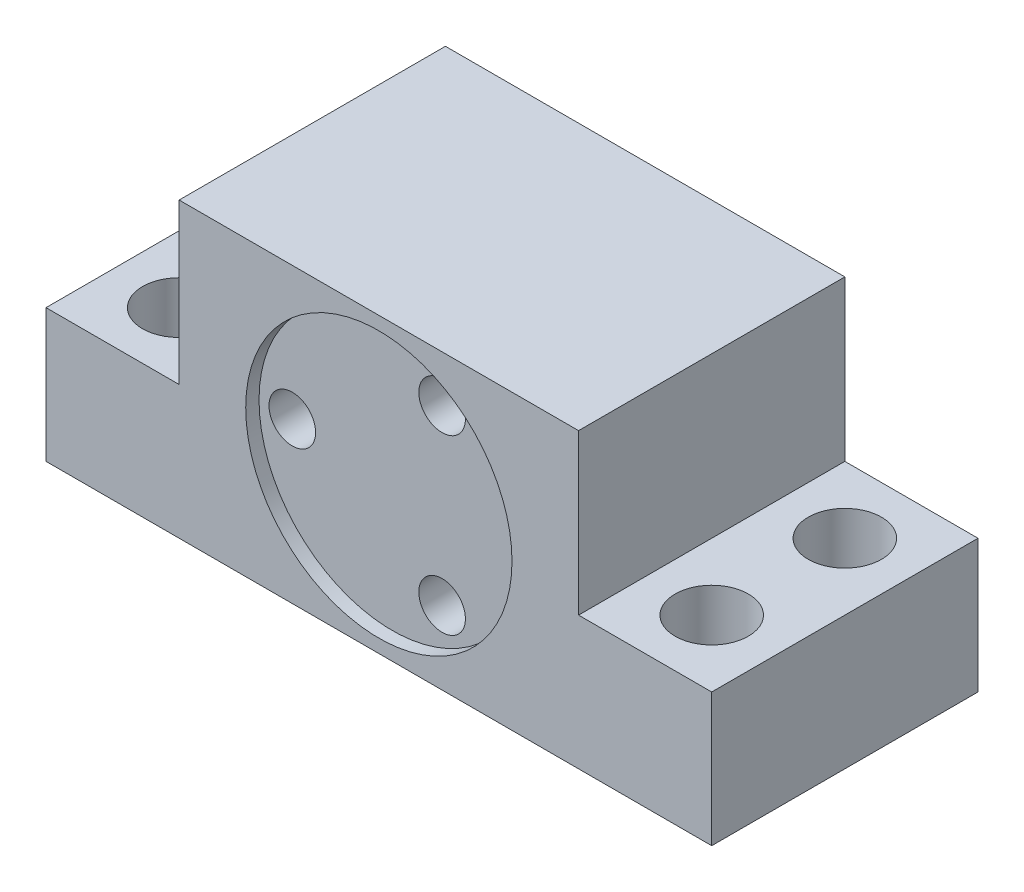
ISO-10303-21;
HEADER;
FILE_DESCRIPTION(('STEP AP214'),'2;1');
FILE_NAME('part.step','',(''),(''),'','','');
FILE_SCHEMA(('AUTOMOTIVE_DESIGN { 1 0 10303 214 1 1 1 1 }'));
ENDSEC;
DATA;
#1=APPLICATION_CONTEXT('core data for automotive mechanical design processes');
#2=APPLICATION_PROTOCOL_DEFINITION('international standard','automotive_design',2000,#1);
#3=PRODUCT_CONTEXT('',#1,'mechanical');
#4=PRODUCT('Part','Part','',(#3));
#5=PRODUCT_RELATED_PRODUCT_CATEGORY('part','',(#4));
#6=PRODUCT_DEFINITION_FORMATION('','',#4);
#7=PRODUCT_DEFINITION_CONTEXT('part definition',#1,'design');
#8=PRODUCT_DEFINITION('design','',#6,#7);
#9=PRODUCT_DEFINITION_SHAPE('','',#8);
#10=(LENGTH_UNIT() NAMED_UNIT(*) SI_UNIT(.MILLI.,.METRE.));
#11=(NAMED_UNIT(*) PLANE_ANGLE_UNIT() SI_UNIT($,.RADIAN.));
#12=(NAMED_UNIT(*) SI_UNIT($,.STERADIAN.) SOLID_ANGLE_UNIT());
#13=UNCERTAINTY_MEASURE_WITH_UNIT(LENGTH_MEASURE(1.E-05),#10,'distance_accuracy_value','');
#14=(GEOMETRIC_REPRESENTATION_CONTEXT(3) GLOBAL_UNCERTAINTY_ASSIGNED_CONTEXT((#13)) GLOBAL_UNIT_ASSIGNED_CONTEXT((#10,
#11,#12)) REPRESENTATION_CONTEXT('',''));
#15=CARTESIAN_POINT('',(0.,0.,0.));
#16=DIRECTION('',(0.,0.,1.));
#17=DIRECTION('',(1.,0.,0.));
#18=AXIS2_PLACEMENT_3D('',#15,#16,#17);
#19=CARTESIAN_POINT('',(15.,22.,20.));
#20=DIRECTION('',(-1.,0.,0.));
#21=DIRECTION('',(0.,-1.,0.));
#22=AXIS2_PLACEMENT_3D('',#19,#20,#21);
#23=PLANE('',#22);
#24=DIRECTION('',(0.,1.,0.));
#25=VECTOR('',#24,1.);
#26=CARTESIAN_POINT('',(15.,22.,0.));
#27=LINE('',#26,#25);
#28=CARTESIAN_POINT('',(15.,10.,0.));
#29=VERTEX_POINT('',#28);
#30=CARTESIAN_POINT('',(15.,22.,0.));
#31=VERTEX_POINT('',#30);
#32=EDGE_CURVE('E113',#29,#31,#27,.T.);
#33=ORIENTED_EDGE('',*,*,#32,.T.);
#34=DIRECTION('',(0.,0.,-1.));
#35=VECTOR('',#34,1.);
#36=CARTESIAN_POINT('',(15.,22.,20.));
#37=LINE('',#36,#35);
#38=CARTESIAN_POINT('',(15.,22.,20.));
#39=VERTEX_POINT('',#38);
#40=EDGE_CURVE('E11',#39,#31,#37,.T.);
#41=ORIENTED_EDGE('',*,*,#40,.F.);
#42=DIRECTION('',(0.,1.,0.));
#43=VECTOR('',#42,1.);
#44=CARTESIAN_POINT('',(15.,22.,20.));
#45=LINE('',#44,#43);
#46=CARTESIAN_POINT('',(15.,10.,20.));
#47=VERTEX_POINT('',#46);
#48=EDGE_CURVE('E128',#47,#39,#45,.T.);
#49=ORIENTED_EDGE('',*,*,#48,.F.);
#50=DIRECTION('',(0.,0.,-1.));
#51=VECTOR('',#50,1.);
#52=CARTESIAN_POINT('',(15.,10.,20.));
#53=LINE('',#52,#51);
#54=EDGE_CURVE('E109',#47,#29,#53,.T.);
#55=ORIENTED_EDGE('',*,*,#54,.T.);
#56=EDGE_LOOP('',(#33,#41,#49,#55));
#57=FACE_BOUND('',#56,.T.);
#58=ADVANCED_FACE('F17',(#57),#23,.F.);
#59=CARTESIAN_POINT('',(-15.,22.,20.));
#60=DIRECTION('',(0.,-1.,0.));
#61=DIRECTION('',(0.,0.,-1.));
#62=AXIS2_PLACEMENT_3D('',#59,#60,#61);
#63=PLANE('',#62);
#64=DIRECTION('',(-1.,0.,0.));
#65=VECTOR('',#64,1.);
#66=CARTESIAN_POINT('',(-15.,22.,0.));
#67=LINE('',#66,#65);
#68=CARTESIAN_POINT('',(-15.,22.,0.));
#69=VERTEX_POINT('',#68);
#70=EDGE_CURVE('E116',#31,#69,#67,.T.);
#71=ORIENTED_EDGE('',*,*,#70,.T.);
#72=DIRECTION('',(0.,0.,-1.));
#73=VECTOR('',#72,1.);
#74=CARTESIAN_POINT('',(-15.,22.,20.));
#75=LINE('',#74,#73);
#76=CARTESIAN_POINT('',(-15.,22.,20.));
#77=VERTEX_POINT('',#76);
#78=EDGE_CURVE('E25',#77,#69,#75,.T.);
#79=ORIENTED_EDGE('',*,*,#78,.F.);
#80=DIRECTION('',(-1.,0.,0.));
#81=VECTOR('',#80,1.);
#82=CARTESIAN_POINT('',(-15.,22.,20.));
#83=LINE('',#82,#81);
#84=EDGE_CURVE('E76',#39,#77,#83,.T.);
#85=ORIENTED_EDGE('',*,*,#84,.F.);
#86=ORIENTED_EDGE('',*,*,#40,.T.);
#87=EDGE_LOOP('',(#71,#79,#85,#86));
#88=FACE_BOUND('',#87,.T.);
#89=ADVANCED_FACE('F237',(#88),#63,.F.);
#90=CARTESIAN_POINT('',(-15.,22.,20.));
#91=DIRECTION('',(1.,0.,0.));
#92=DIRECTION('',(0.,1.,0.));
#93=AXIS2_PLACEMENT_3D('',#90,#91,#92);
#94=PLANE('',#93);
#95=DIRECTION('',(0.,-1.,0.));
#96=VECTOR('',#95,1.);
#97=CARTESIAN_POINT('',(-15.,22.,0.));
#98=LINE('',#97,#96);
#99=CARTESIAN_POINT('',(-15.,10.,0.));
#100=VERTEX_POINT('',#99);
#101=EDGE_CURVE('E119',#69,#100,#98,.T.);
#102=ORIENTED_EDGE('',*,*,#101,.T.);
#103=DIRECTION('',(0.,0.,-1.));
#104=VECTOR('',#103,1.);
#105=CARTESIAN_POINT('',(-15.,10.,20.));
#106=LINE('',#105,#104);
#107=CARTESIAN_POINT('',(-15.,10.,20.));
#108=VERTEX_POINT('',#107);
#109=EDGE_CURVE('E135',#108,#100,#106,.T.);
#110=ORIENTED_EDGE('',*,*,#109,.F.);
#111=DIRECTION('',(0.,-1.,0.));
#112=VECTOR('',#111,1.);
#113=CARTESIAN_POINT('',(-15.,22.,20.));
#114=LINE('',#113,#112);
#115=EDGE_CURVE('E143',#77,#108,#114,.T.);
#116=ORIENTED_EDGE('',*,*,#115,.F.);
#117=ORIENTED_EDGE('',*,*,#78,.T.);
#118=EDGE_LOOP('',(#102,#110,#116,#117));
#119=FACE_BOUND('',#118,.T.);
#120=ADVANCED_FACE('F141',(#119),#94,.F.);
#121=CARTESIAN_POINT('',(-15.,10.,20.));
#122=DIRECTION('',(0.,-1.,0.));
#123=DIRECTION('',(0.,0.,-1.));
#124=AXIS2_PLACEMENT_3D('',#121,#122,#123);
#125=PLANE('',#124);
#126=CARTESIAN_POINT('',(-20.,10.,15.));
#127=DIRECTION('',(0.,1.,0.));
#128=DIRECTION('',(0.,0.,1.));
#129=AXIS2_PLACEMENT_3D('',#126,#127,#128);
#130=CIRCLE('',#129,2.75);
#131=CARTESIAN_POINT('',(-20.,10.,17.75));
#132=VERTEX_POINT('',#131);
#133=EDGE_CURVE('E187',#132,#132,#130,.T.);
#134=ORIENTED_EDGE('',*,*,#133,.F.);
#135=EDGE_LOOP('',(#134));
#136=FACE_BOUND('',#135,.T.);
#137=CARTESIAN_POINT('',(-20.,10.,5.));
#138=DIRECTION('',(0.,1.,0.));
#139=DIRECTION('',(0.,0.,1.));
#140=AXIS2_PLACEMENT_3D('',#137,#138,#139);
#141=CIRCLE('',#140,2.75);
#142=CARTESIAN_POINT('',(-20.,10.,7.75));
#143=VERTEX_POINT('',#142);
#144=EDGE_CURVE('E181',#143,#143,#141,.T.);
#145=ORIENTED_EDGE('',*,*,#144,.F.);
#146=EDGE_LOOP('',(#145));
#147=FACE_BOUND('',#146,.T.);
#148=DIRECTION('',(-1.,0.,0.));
#149=VECTOR('',#148,1.);
#150=CARTESIAN_POINT('',(-15.,10.,0.));
#151=LINE('',#150,#149);
#152=CARTESIAN_POINT('',(-25.,10.,0.));
#153=VERTEX_POINT('',#152);
#154=EDGE_CURVE('E121',#100,#153,#151,.T.);
#155=ORIENTED_EDGE('',*,*,#154,.T.);
#156=DIRECTION('',(0.,0.,-1.));
#157=VECTOR('',#156,1.);
#158=CARTESIAN_POINT('',(-25.,10.,20.));
#159=LINE('',#158,#157);
#160=CARTESIAN_POINT('',(-25.,10.,20.));
#161=VERTEX_POINT('',#160);
#162=EDGE_CURVE('E132',#161,#153,#159,.T.);
#163=ORIENTED_EDGE('',*,*,#162,.F.);
#164=DIRECTION('',(-1.,0.,0.));
#165=VECTOR('',#164,1.);
#166=CARTESIAN_POINT('',(-15.,10.,20.));
#167=LINE('',#166,#165);
#168=EDGE_CURVE('E155',#108,#161,#167,.T.);
#169=ORIENTED_EDGE('',*,*,#168,.F.);
#170=ORIENTED_EDGE('',*,*,#109,.T.);
#171=EDGE_LOOP('',(#155,#163,#169,#170));
#172=FACE_BOUND('',#171,.T.);
#173=ADVANCED_FACE('F151',(#136,#147,#172),#125,.F.);
#174=CARTESIAN_POINT('',(-25.,10.,20.));
#175=DIRECTION('',(1.,0.,0.));
#176=DIRECTION('',(0.,0.,-1.));
#177=AXIS2_PLACEMENT_3D('',#174,#175,#176);
#178=PLANE('',#177);
#179=DIRECTION('',(0.,-1.,0.));
#180=VECTOR('',#179,1.);
#181=CARTESIAN_POINT('',(-25.,10.,0.));
#182=LINE('',#181,#180);
#183=CARTESIAN_POINT('',(-25.,0.,0.));
#184=VERTEX_POINT('',#183);
#185=EDGE_CURVE('E123',#153,#184,#182,.T.);
#186=ORIENTED_EDGE('',*,*,#185,.T.);
#187=DIRECTION('',(0.,0.,-1.));
#188=VECTOR('',#187,1.);
#189=CARTESIAN_POINT('',(-25.,0.,20.));
#190=LINE('',#189,#188);
#191=CARTESIAN_POINT('',(-25.,0.,20.));
#192=VERTEX_POINT('',#191);
#193=EDGE_CURVE('E104',#192,#184,#190,.T.);
#194=ORIENTED_EDGE('',*,*,#193,.F.);
#195=DIRECTION('',(0.,-1.,0.));
#196=VECTOR('',#195,1.);
#197=CARTESIAN_POINT('',(-25.,10.,20.));
#198=LINE('',#197,#196);
#199=EDGE_CURVE('E95',#161,#192,#198,.T.);
#200=ORIENTED_EDGE('',*,*,#199,.F.);
#201=ORIENTED_EDGE('',*,*,#162,.T.);
#202=EDGE_LOOP('',(#186,#194,#200,#201));
#203=FACE_BOUND('',#202,.T.);
#204=ADVANCED_FACE('F154',(#203),#178,.F.);
#205=CARTESIAN_POINT('',(25.,0.,20.));
#206=DIRECTION('',(0.,1.,0.));
#207=DIRECTION('',(0.,0.,1.));
#208=AXIS2_PLACEMENT_3D('',#205,#206,#207);
#209=PLANE('',#208);
#210=CARTESIAN_POINT('',(-20.,0.,15.));
#211=DIRECTION('',(0.,1.,0.));
#212=DIRECTION('',(0.,0.,1.));
#213=AXIS2_PLACEMENT_3D('',#210,#211,#212);
#214=CIRCLE('',#213,2.75);
#215=CARTESIAN_POINT('',(-20.,0.,17.75));
#216=VERTEX_POINT('',#215);
#217=EDGE_CURVE('E184',#216,#216,#214,.T.);
#218=ORIENTED_EDGE('',*,*,#217,.T.);
#219=EDGE_LOOP('',(#218));
#220=FACE_BOUND('',#219,.T.);
#221=CARTESIAN_POINT('',(-20.,0.,5.));
#222=DIRECTION('',(0.,1.,0.));
#223=DIRECTION('',(0.,0.,1.));
#224=AXIS2_PLACEMENT_3D('',#221,#222,#223);
#225=CIRCLE('',#224,2.75);
#226=CARTESIAN_POINT('',(-20.,0.,7.75));
#227=VERTEX_POINT('',#226);
#228=EDGE_CURVE('E178',#227,#227,#225,.T.);
#229=ORIENTED_EDGE('',*,*,#228,.T.);
#230=EDGE_LOOP('',(#229));
#231=FACE_BOUND('',#230,.T.);
#232=CARTESIAN_POINT('',(20.,0.,15.));
#233=DIRECTION('',(0.,1.,0.));
#234=DIRECTION('',(0.,0.,1.));
#235=AXIS2_PLACEMENT_3D('',#232,#233,#234);
#236=CIRCLE('',#235,2.75);
#237=CARTESIAN_POINT('',(20.,0.,17.75));
#238=VERTEX_POINT('',#237);
#239=EDGE_CURVE('E172',#238,#238,#236,.T.);
#240=ORIENTED_EDGE('',*,*,#239,.T.);
#241=EDGE_LOOP('',(#240));
#242=FACE_BOUND('',#241,.T.);
#243=CARTESIAN_POINT('',(20.,0.,5.));
#244=DIRECTION('',(0.,1.,0.));
#245=DIRECTION('',(0.,0.,1.));
#246=AXIS2_PLACEMENT_3D('',#243,#244,#245);
#247=CIRCLE('',#246,2.75);
#248=CARTESIAN_POINT('',(20.,0.,7.75));
#249=VERTEX_POINT('',#248);
#250=EDGE_CURVE('E164',#249,#249,#247,.T.);
#251=ORIENTED_EDGE('',*,*,#250,.T.);
#252=EDGE_LOOP('',(#251));
#253=FACE_BOUND('',#252,.T.);
#254=DIRECTION('',(1.,0.,0.));
#255=VECTOR('',#254,1.);
#256=CARTESIAN_POINT('',(25.,0.,0.));
#257=LINE('',#256,#255);
#258=CARTESIAN_POINT('',(25.,0.,0.));
#259=VERTEX_POINT('',#258);
#260=EDGE_CURVE('E103',#184,#259,#257,.T.);
#261=ORIENTED_EDGE('',*,*,#260,.T.);
#262=DIRECTION('',(0.,0.,-1.));
#263=VECTOR('',#262,1.);
#264=CARTESIAN_POINT('',(25.,0.,20.));
#265=LINE('',#264,#263);
#266=CARTESIAN_POINT('',(25.,0.,20.));
#267=VERTEX_POINT('',#266);
#268=EDGE_CURVE('E100',#267,#259,#265,.T.);
#269=ORIENTED_EDGE('',*,*,#268,.F.);
#270=DIRECTION('',(1.,0.,0.));
#271=VECTOR('',#270,1.);
#272=CARTESIAN_POINT('',(25.,0.,20.));
#273=LINE('',#272,#271);
#274=EDGE_CURVE('E89',#192,#267,#273,.T.);
#275=ORIENTED_EDGE('',*,*,#274,.F.);
#276=ORIENTED_EDGE('',*,*,#193,.T.);
#277=EDGE_LOOP('',(#261,#269,#275,#276));
#278=FACE_BOUND('',#277,.T.);
#279=ADVANCED_FACE('F101',(#220,#231,#242,#253,#278),#209,.F.);
#280=CARTESIAN_POINT('',(25.,10.,20.));
#281=DIRECTION('',(-1.,0.,0.));
#282=DIRECTION('',(0.,0.,1.));
#283=AXIS2_PLACEMENT_3D('',#280,#281,#282);
#284=PLANE('',#283);
#285=DIRECTION('',(0.,1.,0.));
#286=VECTOR('',#285,1.);
#287=CARTESIAN_POINT('',(25.,10.,0.));
#288=LINE('',#287,#286);
#289=CARTESIAN_POINT('',(25.,10.,0.));
#290=VERTEX_POINT('',#289);
#291=EDGE_CURVE('E62',#259,#290,#288,.T.);
#292=ORIENTED_EDGE('',*,*,#291,.T.);
#293=DIRECTION('',(0.,0.,-1.));
#294=VECTOR('',#293,1.);
#295=CARTESIAN_POINT('',(25.,10.,20.));
#296=LINE('',#295,#294);
#297=CARTESIAN_POINT('',(25.,10.,20.));
#298=VERTEX_POINT('',#297);
#299=EDGE_CURVE('E105',#298,#290,#296,.T.);
#300=ORIENTED_EDGE('',*,*,#299,.F.);
#301=DIRECTION('',(0.,1.,0.));
#302=VECTOR('',#301,1.);
#303=CARTESIAN_POINT('',(25.,10.,20.));
#304=LINE('',#303,#302);
#305=EDGE_CURVE('E93',#267,#298,#304,.T.);
#306=ORIENTED_EDGE('',*,*,#305,.F.);
#307=ORIENTED_EDGE('',*,*,#268,.T.);
#308=EDGE_LOOP('',(#292,#300,#306,#307));
#309=FACE_BOUND('',#308,.T.);
#310=ADVANCED_FACE('F107',(#309),#284,.F.);
#311=CARTESIAN_POINT('',(15.,10.,20.));
#312=DIRECTION('',(0.,-1.,0.));
#313=DIRECTION('',(0.,0.,-1.));
#314=AXIS2_PLACEMENT_3D('',#311,#312,#313);
#315=PLANE('',#314);
#316=CARTESIAN_POINT('',(20.,10.,15.));
#317=DIRECTION('',(0.,1.,0.));
#318=DIRECTION('',(0.,0.,1.));
#319=AXIS2_PLACEMENT_3D('',#316,#317,#318);
#320=CIRCLE('',#319,2.75);
#321=CARTESIAN_POINT('',(20.,10.,17.75));
#322=VERTEX_POINT('',#321);
#323=EDGE_CURVE('E175',#322,#322,#320,.T.);
#324=ORIENTED_EDGE('',*,*,#323,.F.);
#325=EDGE_LOOP('',(#324));
#326=FACE_BOUND('',#325,.T.);
#327=CARTESIAN_POINT('',(20.,10.,5.));
#328=DIRECTION('',(0.,1.,0.));
#329=DIRECTION('',(0.,0.,1.));
#330=AXIS2_PLACEMENT_3D('',#327,#328,#329);
#331=CIRCLE('',#330,2.75);
#332=CARTESIAN_POINT('',(20.,10.,7.75));
#333=VERTEX_POINT('',#332);
#334=EDGE_CURVE('E169',#333,#333,#331,.T.);
#335=ORIENTED_EDGE('',*,*,#334,.F.);
#336=EDGE_LOOP('',(#335));
#337=FACE_BOUND('',#336,.T.);
#338=DIRECTION('',(-1.,0.,0.));
#339=VECTOR('',#338,1.);
#340=CARTESIAN_POINT('',(15.,10.,0.));
#341=LINE('',#340,#339);
#342=EDGE_CURVE('E68',#290,#29,#341,.T.);
#343=ORIENTED_EDGE('',*,*,#342,.T.);
#344=ORIENTED_EDGE('',*,*,#54,.F.);
#345=DIRECTION('',(-1.,0.,0.));
#346=VECTOR('',#345,1.);
#347=CARTESIAN_POINT('',(15.,10.,20.));
#348=LINE('',#347,#346);
#349=EDGE_CURVE('E33',#298,#47,#348,.T.);
#350=ORIENTED_EDGE('',*,*,#349,.F.);
#351=ORIENTED_EDGE('',*,*,#299,.T.);
#352=EDGE_LOOP('',(#343,#344,#350,#351));
#353=FACE_BOUND('',#352,.T.);
#354=ADVANCED_FACE('F245',(#326,#337,#353),#315,.F.);
#355=CARTESIAN_POINT('',(0.,0.,20.));
#356=DIRECTION('',(0.,0.,1.));
#357=DIRECTION('',(1.,0.,0.));
#358=AXIS2_PLACEMENT_3D('',#355,#356,#357);
#359=PLANE('',#358);
#360=CARTESIAN_POINT('',(0.,11.,20.));
#361=DIRECTION('',(0.,0.,1.));
#362=DIRECTION('',(1.,0.,0.));
#363=AXIS2_PLACEMENT_3D('',#360,#361,#362);
#364=CIRCLE('',#363,10.);
#365=CARTESIAN_POINT('',(10.,11.,20.));
#366=VERTEX_POINT('',#365);
#367=EDGE_CURVE('E161',#366,#366,#364,.T.);
#368=ORIENTED_EDGE('',*,*,#367,.F.);
#369=EDGE_LOOP('',(#368));
#370=FACE_BOUND('',#369,.T.);
#371=ORIENTED_EDGE('',*,*,#48,.T.);
#372=ORIENTED_EDGE('',*,*,#84,.T.);
#373=ORIENTED_EDGE('',*,*,#115,.T.);
#374=ORIENTED_EDGE('',*,*,#168,.T.);
#375=ORIENTED_EDGE('',*,*,#199,.T.);
#376=ORIENTED_EDGE('',*,*,#274,.T.);
#377=ORIENTED_EDGE('',*,*,#305,.T.);
#378=ORIENTED_EDGE('',*,*,#349,.T.);
#379=EDGE_LOOP('',(#371,#372,#373,#374,#375,#376,#377,#378));
#380=FACE_BOUND('',#379,.T.);
#381=ADVANCED_FACE('F91',(#370,#380),#359,.T.);
#382=CARTESIAN_POINT('',(0.,0.,0.));
#383=DIRECTION('',(0.,0.,1.));
#384=DIRECTION('',(1.,0.,0.));
#385=AXIS2_PLACEMENT_3D('',#382,#383,#384);
#386=PLANE('',#385);
#387=CARTESIAN_POINT('',(3.74999999999994,17.4951905283833,0.));
#388=DIRECTION('',(0.,0.,-1.));
#389=DIRECTION('',(-1.,0.,0.));
#390=AXIS2_PLACEMENT_3D('',#387,#388,#389);
#391=CIRCLE('',#390,1.75);
#392=CARTESIAN_POINT('',(1.99999999999994,17.4951905283833,0.));
#393=VERTEX_POINT('',#392);
#394=EDGE_CURVE('E205',#393,#393,#391,.T.);
#395=ORIENTED_EDGE('',*,*,#394,.F.);
#396=EDGE_LOOP('',(#395));
#397=FACE_BOUND('',#396,.T.);
#398=CARTESIAN_POINT('',(3.75,4.50480947161673,0.));
#399=DIRECTION('',(0.,0.,-1.));
#400=DIRECTION('',(-1.,0.,0.));
#401=AXIS2_PLACEMENT_3D('',#398,#399,#400);
#402=CIRCLE('',#401,1.75);
#403=CARTESIAN_POINT('',(2.,4.50480947161673,0.));
#404=VERTEX_POINT('',#403);
#405=EDGE_CURVE('E199',#404,#404,#402,.T.);
#406=ORIENTED_EDGE('',*,*,#405,.F.);
#407=EDGE_LOOP('',(#406));
#408=FACE_BOUND('',#407,.T.);
#409=CARTESIAN_POINT('',(-7.5,11.,0.));
#410=DIRECTION('',(0.,0.,-1.));
#411=DIRECTION('',(-1.,0.,0.));
#412=AXIS2_PLACEMENT_3D('',#409,#410,#411);
#413=CIRCLE('',#412,1.75);
#414=CARTESIAN_POINT('',(-9.25,11.,0.));
#415=VERTEX_POINT('',#414);
#416=EDGE_CURVE('E193',#415,#415,#413,.T.);
#417=ORIENTED_EDGE('',*,*,#416,.F.);
#418=EDGE_LOOP('',(#417));
#419=FACE_BOUND('',#418,.T.);
#420=ORIENTED_EDGE('',*,*,#32,.F.);
#421=ORIENTED_EDGE('',*,*,#342,.F.);
#422=ORIENTED_EDGE('',*,*,#291,.F.);
#423=ORIENTED_EDGE('',*,*,#260,.F.);
#424=ORIENTED_EDGE('',*,*,#185,.F.);
#425=ORIENTED_EDGE('',*,*,#154,.F.);
#426=ORIENTED_EDGE('',*,*,#101,.F.);
#427=ORIENTED_EDGE('',*,*,#70,.F.);
#428=EDGE_LOOP('',(#420,#421,#422,#423,#424,#425,#426,#427));
#429=FACE_BOUND('',#428,.T.);
#430=ADVANCED_FACE('F147',(#397,#408,#419,#429),#386,.F.);
#431=CARTESIAN_POINT('',(0.,11.,19.));
#432=DIRECTION('',(0.,0.,1.));
#433=DIRECTION('',(1.,0.,0.));
#434=AXIS2_PLACEMENT_3D('',#431,#432,#433);
#435=CYLINDRICAL_SURFACE('',#434,10.);
#436=CARTESIAN_POINT('',(0.,11.,19.));
#437=DIRECTION('',(0.,0.,1.));
#438=DIRECTION('',(1.,0.,0.));
#439=AXIS2_PLACEMENT_3D('',#436,#437,#438);
#440=CIRCLE('',#439,10.);
#441=CARTESIAN_POINT('',(10.,11.,19.));
#442=VERTEX_POINT('',#441);
#443=EDGE_CURVE('E117',#442,#442,#440,.T.);
#444=ORIENTED_EDGE('',*,*,#443,.F.);
#445=EDGE_LOOP('',(#444));
#446=FACE_BOUND('',#445,.T.);
#447=ORIENTED_EDGE('',*,*,#367,.T.);
#448=EDGE_LOOP('',(#447));
#449=FACE_BOUND('',#448,.T.);
#450=ADVANCED_FACE('F213',(#446,#449),#435,.F.);
#451=CARTESIAN_POINT('',(0.,11.,19.));
#452=DIRECTION('',(0.,0.,1.));
#453=DIRECTION('',(1.,0.,0.));
#454=AXIS2_PLACEMENT_3D('',#451,#452,#453);
#455=PLANE('',#454);
#456=CARTESIAN_POINT('',(3.74999999999994,17.4951905283833,19.));
#457=DIRECTION('',(0.,0.,1.));
#458=DIRECTION('',(1.,0.,0.));
#459=AXIS2_PLACEMENT_3D('',#456,#457,#458);
#460=CIRCLE('',#459,1.75);
#461=CARTESIAN_POINT('',(5.49999999999994,17.4951905283833,19.));
#462=VERTEX_POINT('',#461);
#463=EDGE_CURVE('E202',#462,#462,#460,.T.);
#464=ORIENTED_EDGE('',*,*,#463,.F.);
#465=EDGE_LOOP('',(#464));
#466=FACE_BOUND('',#465,.T.);
#467=CARTESIAN_POINT('',(3.75,4.50480947161673,19.));
#468=DIRECTION('',(0.,0.,1.));
#469=DIRECTION('',(1.,0.,0.));
#470=AXIS2_PLACEMENT_3D('',#467,#468,#469);
#471=CIRCLE('',#470,1.75);
#472=CARTESIAN_POINT('',(5.5,4.50480947161673,19.));
#473=VERTEX_POINT('',#472);
#474=EDGE_CURVE('E196',#473,#473,#471,.T.);
#475=ORIENTED_EDGE('',*,*,#474,.F.);
#476=EDGE_LOOP('',(#475));
#477=FACE_BOUND('',#476,.T.);
#478=CARTESIAN_POINT('',(-7.5,11.,19.));
#479=DIRECTION('',(0.,0.,1.));
#480=DIRECTION('',(1.,0.,0.));
#481=AXIS2_PLACEMENT_3D('',#478,#479,#480);
#482=CIRCLE('',#481,1.75);
#483=CARTESIAN_POINT('',(-5.75,11.,19.));
#484=VERTEX_POINT('',#483);
#485=EDGE_CURVE('E190',#484,#484,#482,.T.);
#486=ORIENTED_EDGE('',*,*,#485,.F.);
#487=EDGE_LOOP('',(#486));
#488=FACE_BOUND('',#487,.T.);
#489=ORIENTED_EDGE('',*,*,#443,.T.);
#490=EDGE_LOOP('',(#489));
#491=FACE_BOUND('',#490,.T.);
#492=ADVANCED_FACE('F325',(#466,#477,#488,#491),#455,.T.);
#493=CARTESIAN_POINT('',(20.,10.,5.));
#494=DIRECTION('',(0.,1.,0.));
#495=DIRECTION('',(0.,0.,1.));
#496=AXIS2_PLACEMENT_3D('',#493,#494,#495);
#497=CYLINDRICAL_SURFACE('',#496,2.75);
#498=ORIENTED_EDGE('',*,*,#250,.F.);
#499=EDGE_LOOP('',(#498));
#500=FACE_BOUND('',#499,.T.);
#501=ORIENTED_EDGE('',*,*,#334,.T.);
#502=EDGE_LOOP('',(#501));
#503=FACE_BOUND('',#502,.T.);
#504=ADVANCED_FACE('F336',(#500,#503),#497,.F.);
#505=CARTESIAN_POINT('',(20.,10.,15.));
#506=DIRECTION('',(0.,1.,0.));
#507=DIRECTION('',(0.,0.,1.));
#508=AXIS2_PLACEMENT_3D('',#505,#506,#507);
#509=CYLINDRICAL_SURFACE('',#508,2.75);
#510=ORIENTED_EDGE('',*,*,#239,.F.);
#511=EDGE_LOOP('',(#510));
#512=FACE_BOUND('',#511,.T.);
#513=ORIENTED_EDGE('',*,*,#323,.T.);
#514=EDGE_LOOP('',(#513));
#515=FACE_BOUND('',#514,.T.);
#516=ADVANCED_FACE('F347',(#512,#515),#509,.F.);
#517=CARTESIAN_POINT('',(-20.,10.,5.));
#518=DIRECTION('',(0.,1.,0.));
#519=DIRECTION('',(0.,0.,1.));
#520=AXIS2_PLACEMENT_3D('',#517,#518,#519);
#521=CYLINDRICAL_SURFACE('',#520,2.75);
#522=ORIENTED_EDGE('',*,*,#228,.F.);
#523=EDGE_LOOP('',(#522));
#524=FACE_BOUND('',#523,.T.);
#525=ORIENTED_EDGE('',*,*,#144,.T.);
#526=EDGE_LOOP('',(#525));
#527=FACE_BOUND('',#526,.T.);
#528=ADVANCED_FACE('F233',(#524,#527),#521,.F.);
#529=CARTESIAN_POINT('',(-20.,10.,15.));
#530=DIRECTION('',(0.,1.,0.));
#531=DIRECTION('',(0.,0.,1.));
#532=AXIS2_PLACEMENT_3D('',#529,#530,#531);
#533=CYLINDRICAL_SURFACE('',#532,2.75);
#534=ORIENTED_EDGE('',*,*,#217,.F.);
#535=EDGE_LOOP('',(#534));
#536=FACE_BOUND('',#535,.T.);
#537=ORIENTED_EDGE('',*,*,#133,.T.);
#538=EDGE_LOOP('',(#537));
#539=FACE_BOUND('',#538,.T.);
#540=ADVANCED_FACE('F222',(#536,#539),#533,.F.);
#541=CARTESIAN_POINT('',(-7.5,11.,0.));
#542=DIRECTION('',(0.,0.,-1.));
#543=DIRECTION('',(-1.,0.,0.));
#544=AXIS2_PLACEMENT_3D('',#541,#542,#543);
#545=CYLINDRICAL_SURFACE('',#544,1.75);
#546=ORIENTED_EDGE('',*,*,#485,.T.);
#547=EDGE_LOOP('',(#546));
#548=FACE_BOUND('',#547,.T.);
#549=ORIENTED_EDGE('',*,*,#416,.T.);
#550=EDGE_LOOP('',(#549));
#551=FACE_BOUND('',#550,.T.);
#552=ADVANCED_FACE('F219',(#548,#551),#545,.F.);
#553=CARTESIAN_POINT('',(3.75,4.50480947161673,0.));
#554=DIRECTION('',(0.,0.,-1.));
#555=DIRECTION('',(-1.,0.,0.));
#556=AXIS2_PLACEMENT_3D('',#553,#554,#555);
#557=CYLINDRICAL_SURFACE('',#556,1.75);
#558=ORIENTED_EDGE('',*,*,#474,.T.);
#559=EDGE_LOOP('',(#558));
#560=FACE_BOUND('',#559,.T.);
#561=ORIENTED_EDGE('',*,*,#405,.T.);
#562=EDGE_LOOP('',(#561));
#563=FACE_BOUND('',#562,.T.);
#564=ADVANCED_FACE('F221',(#560,#563),#557,.F.);
#565=CARTESIAN_POINT('',(3.74999999999994,17.4951905283833,0.));
#566=DIRECTION('',(0.,0.,-1.));
#567=DIRECTION('',(-1.,0.,0.));
#568=AXIS2_PLACEMENT_3D('',#565,#566,#567);
#569=CYLINDRICAL_SURFACE('',#568,1.75);
#570=ORIENTED_EDGE('',*,*,#463,.T.);
#571=EDGE_LOOP('',(#570));
#572=FACE_BOUND('',#571,.T.);
#573=ORIENTED_EDGE('',*,*,#394,.T.);
#574=EDGE_LOOP('',(#573));
#575=FACE_BOUND('',#574,.T.);
#576=ADVANCED_FACE('F209',(#572,#575),#569,.F.);
#577=CLOSED_SHELL('',(#58,#89,#120,#173,#204,#279,#310,#354,#381,#430,#450,#492,#504,#516,#528,
#540,#552,#564,#576));
#578=MANIFOLD_SOLID_BREP('B1',#577);
#579=ADVANCED_BREP_SHAPE_REPRESENTATION('',(#18,#578),#14);
#580=SHAPE_DEFINITION_REPRESENTATION(#9,#579);
ENDSEC;
END-ISO-10303-21;
